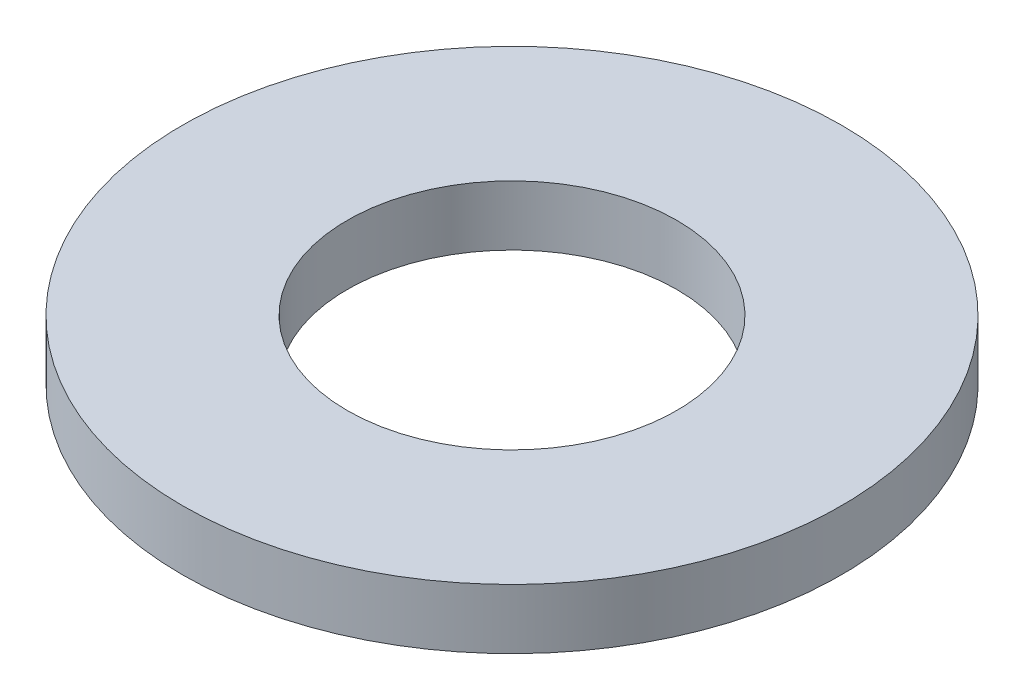
ISO-10303-21;
HEADER;
FILE_DESCRIPTION(('STEP AP214'),'2;1');
FILE_NAME('part.step','',(''),(''),'','','');
FILE_SCHEMA(('AUTOMOTIVE_DESIGN { 1 0 10303 214 1 1 1 1 }'));
ENDSEC;
DATA;
#1=APPLICATION_CONTEXT('core data for automotive mechanical design processes');
#2=APPLICATION_PROTOCOL_DEFINITION('international standard','automotive_design',2000,#1);
#3=PRODUCT_CONTEXT('',#1,'mechanical');
#4=PRODUCT('Part','Part','',(#3));
#5=PRODUCT_RELATED_PRODUCT_CATEGORY('part','',(#4));
#6=PRODUCT_DEFINITION_FORMATION('','',#4);
#7=PRODUCT_DEFINITION_CONTEXT('part definition',#1,'design');
#8=PRODUCT_DEFINITION('design','',#6,#7);
#9=PRODUCT_DEFINITION_SHAPE('','',#8);
#10=(LENGTH_UNIT() NAMED_UNIT(*) SI_UNIT(.MILLI.,.METRE.));
#11=(NAMED_UNIT(*) PLANE_ANGLE_UNIT() SI_UNIT($,.RADIAN.));
#12=(NAMED_UNIT(*) SI_UNIT($,.STERADIAN.) SOLID_ANGLE_UNIT());
#13=UNCERTAINTY_MEASURE_WITH_UNIT(LENGTH_MEASURE(1.E-05),#10,'distance_accuracy_value','');
#14=(GEOMETRIC_REPRESENTATION_CONTEXT(3) GLOBAL_UNCERTAINTY_ASSIGNED_CONTEXT((#13)) GLOBAL_UNIT_ASSIGNED_CONTEXT((#10,
#11,#12)) REPRESENTATION_CONTEXT('',''));
#15=CARTESIAN_POINT('',(0.,0.,0.));
#16=DIRECTION('',(0.,0.,1.));
#17=DIRECTION('',(1.,0.,0.));
#18=AXIS2_PLACEMENT_3D('',#15,#16,#17);
#19=CARTESIAN_POINT('',(0.,0.8,0.));
#20=DIRECTION('',(0.,1.,0.));
#21=DIRECTION('',(0.,0.,1.));
#22=AXIS2_PLACEMENT_3D('',#19,#20,#21);
#23=PLANE('',#22);
#24=CARTESIAN_POINT('',(0.,0.8,0.));
#25=DIRECTION('',(0.,1.,0.));
#26=DIRECTION('',(0.,0.,1.));
#27=AXIS2_PLACEMENT_3D('',#24,#25,#26);
#28=CIRCLE('',#27,4.4);
#29=CARTESIAN_POINT('',(0.,0.8,4.4));
#30=VERTEX_POINT('',#29);
#31=EDGE_CURVE('E10',#30,#30,#28,.T.);
#32=ORIENTED_EDGE('',*,*,#31,.T.);
#33=EDGE_LOOP('',(#32));
#34=FACE_BOUND('',#33,.T.);
#35=CARTESIAN_POINT('',(0.,0.8,0.));
#36=DIRECTION('',(0.,1.,0.));
#37=DIRECTION('',(0.,0.,1.));
#38=AXIS2_PLACEMENT_3D('',#35,#36,#37);
#39=CIRCLE('',#38,2.2);
#40=CARTESIAN_POINT('',(0.,0.8,2.2));
#41=VERTEX_POINT('',#40);
#42=EDGE_CURVE('E50',#41,#41,#39,.T.);
#43=ORIENTED_EDGE('',*,*,#42,.F.);
#44=EDGE_LOOP('',(#43));
#45=FACE_BOUND('',#44,.T.);
#46=ADVANCED_FACE('F37',(#34,#45),#23,.T.);
#47=CARTESIAN_POINT('',(0.,0.,0.));
#48=DIRECTION('',(0.,1.,0.));
#49=DIRECTION('',(0.,0.,1.));
#50=AXIS2_PLACEMENT_3D('',#47,#48,#49);
#51=PLANE('',#50);
#52=CARTESIAN_POINT('',(0.,0.,0.));
#53=DIRECTION('',(0.,1.,0.));
#54=DIRECTION('',(0.,0.,1.));
#55=AXIS2_PLACEMENT_3D('',#52,#53,#54);
#56=CIRCLE('',#55,4.4);
#57=CARTESIAN_POINT('',(0.,0.,4.4));
#58=VERTEX_POINT('',#57);
#59=EDGE_CURVE('E41',#58,#58,#56,.T.);
#60=ORIENTED_EDGE('',*,*,#59,.F.);
#61=EDGE_LOOP('',(#60));
#62=FACE_BOUND('',#61,.T.);
#63=CARTESIAN_POINT('',(0.,0.,0.));
#64=DIRECTION('',(0.,1.,0.));
#65=DIRECTION('',(0.,0.,1.));
#66=AXIS2_PLACEMENT_3D('',#63,#64,#65);
#67=CIRCLE('',#66,2.2);
#68=CARTESIAN_POINT('',(0.,0.,2.2));
#69=VERTEX_POINT('',#68);
#70=EDGE_CURVE('E52',#69,#69,#67,.T.);
#71=ORIENTED_EDGE('',*,*,#70,.T.);
#72=EDGE_LOOP('',(#71));
#73=FACE_BOUND('',#72,.T.);
#74=ADVANCED_FACE('F64',(#62,#73),#51,.F.);
#75=CARTESIAN_POINT('',(0.,0.8,0.));
#76=DIRECTION('',(0.,-1.,0.));
#77=DIRECTION('',(0.,0.,-1.));
#78=AXIS2_PLACEMENT_3D('',#75,#76,#77);
#79=CYLINDRICAL_SURFACE('',#78,4.4);
#80=ORIENTED_EDGE('',*,*,#31,.F.);
#81=EDGE_LOOP('',(#80));
#82=FACE_BOUND('',#81,.T.);
#83=ORIENTED_EDGE('',*,*,#59,.T.);
#84=EDGE_LOOP('',(#83));
#85=FACE_BOUND('',#84,.T.);
#86=ADVANCED_FACE('F39',(#82,#85),#79,.T.);
#87=CARTESIAN_POINT('',(0.,0.8,0.));
#88=DIRECTION('',(0.,-1.,0.));
#89=DIRECTION('',(0.,0.,-1.));
#90=AXIS2_PLACEMENT_3D('',#87,#88,#89);
#91=CYLINDRICAL_SURFACE('',#90,2.2);
#92=ORIENTED_EDGE('',*,*,#42,.T.);
#93=EDGE_LOOP('',(#92));
#94=FACE_BOUND('',#93,.T.);
#95=ORIENTED_EDGE('',*,*,#70,.F.);
#96=EDGE_LOOP('',(#95));
#97=FACE_BOUND('',#96,.T.);
#98=ADVANCED_FACE('F60',(#94,#97),#91,.F.);
#99=CLOSED_SHELL('',(#46,#74,#86,#98));
#100=MANIFOLD_SOLID_BREP('B2',#99);
#101=ADVANCED_BREP_SHAPE_REPRESENTATION('',(#18,#100),#14);
#102=SHAPE_DEFINITION_REPRESENTATION(#9,#101);
ENDSEC;
END-ISO-10303-21;
